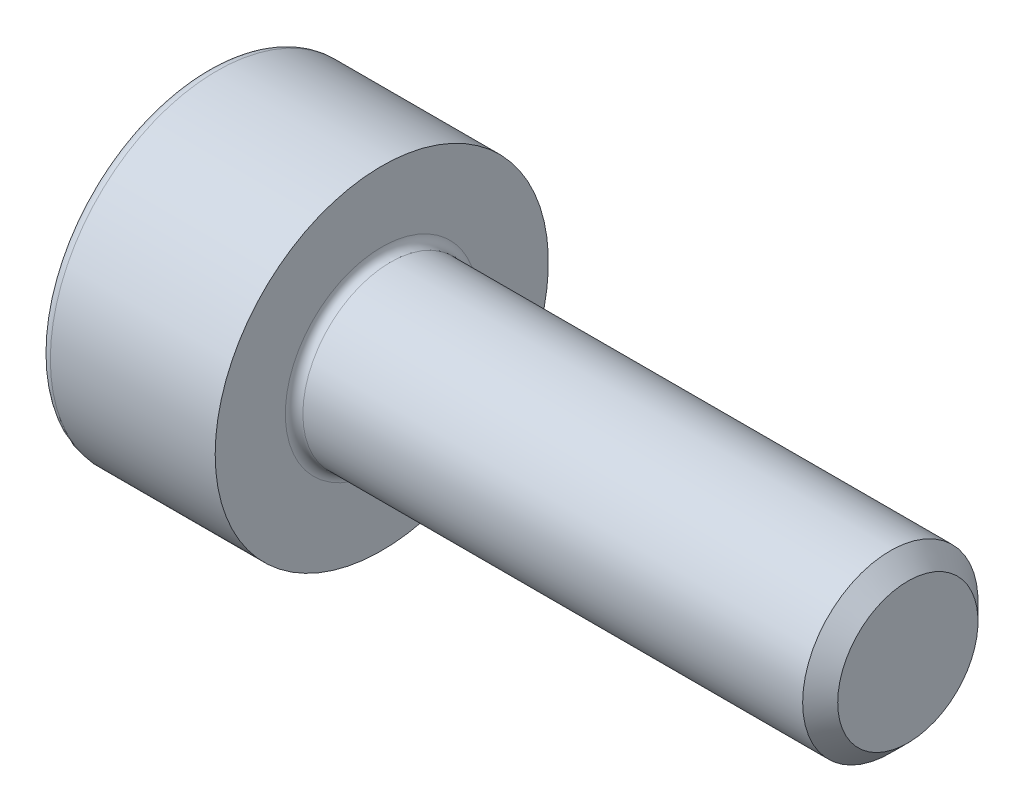
ISO-10303-21;
HEADER;
FILE_DESCRIPTION(('STEP AP214'),'2;1');
FILE_NAME('part.step','',(''),(''),'','','');
FILE_SCHEMA(('AUTOMOTIVE_DESIGN { 1 0 10303 214 1 1 1 1 }'));
ENDSEC;
DATA;
#1=APPLICATION_CONTEXT('core data for automotive mechanical design processes');
#2=APPLICATION_PROTOCOL_DEFINITION('international standard','automotive_design',2000,#1);
#3=PRODUCT_CONTEXT('',#1,'mechanical');
#4=PRODUCT('Part','Part','',(#3));
#5=PRODUCT_RELATED_PRODUCT_CATEGORY('part','',(#4));
#6=PRODUCT_DEFINITION_FORMATION('','',#4);
#7=PRODUCT_DEFINITION_CONTEXT('part definition',#1,'design');
#8=PRODUCT_DEFINITION('design','',#6,#7);
#9=PRODUCT_DEFINITION_SHAPE('','',#8);
#10=(LENGTH_UNIT() NAMED_UNIT(*) SI_UNIT(.MILLI.,.METRE.));
#11=(NAMED_UNIT(*) PLANE_ANGLE_UNIT() SI_UNIT($,.RADIAN.));
#12=(NAMED_UNIT(*) SI_UNIT($,.STERADIAN.) SOLID_ANGLE_UNIT());
#13=UNCERTAINTY_MEASURE_WITH_UNIT(LENGTH_MEASURE(1.E-05),#10,'distance_accuracy_value','');
#14=(GEOMETRIC_REPRESENTATION_CONTEXT(3) GLOBAL_UNCERTAINTY_ASSIGNED_CONTEXT((#13)) GLOBAL_UNIT_ASSIGNED_CONTEXT((#10,
#11,#12)) REPRESENTATION_CONTEXT('',''));
#15=CARTESIAN_POINT('',(0.,0.,0.));
#16=DIRECTION('',(0.,0.,1.));
#17=DIRECTION('',(1.,0.,0.));
#18=AXIS2_PLACEMENT_3D('',#15,#16,#17);
#19=CARTESIAN_POINT('',(8.,0.,0.));
#20=DIRECTION('',(-1.,0.,0.));
#21=DIRECTION('',(0.,0.,1.));
#22=AXIS2_PLACEMENT_3D('',#19,#20,#21);
#23=PLANE('',#22);
#24=CARTESIAN_POINT('',(8.,0.,0.));
#25=DIRECTION('',(-1.,0.,0.));
#26=DIRECTION('',(0.,0.,1.));
#27=AXIS2_PLACEMENT_3D('',#24,#25,#26);
#28=CIRCLE('',#27,0.800000000000001);
#29=CARTESIAN_POINT('',(8.,0.,0.8));
#30=VERTEX_POINT('',#29);
#31=EDGE_CURVE('E11',#30,#30,#28,.F.);
#32=ORIENTED_EDGE('',*,*,#31,.T.);
#33=EDGE_LOOP('',(#32));
#34=FACE_BOUND('',#33,.T.);
#35=ADVANCED_FACE('F35',(#34),#23,.F.);
#36=CARTESIAN_POINT('',(0.,0.,0.));
#37=DIRECTION('',(-1.,0.,0.));
#38=DIRECTION('',(0.,0.,1.));
#39=AXIS2_PLACEMENT_3D('',#36,#37,#38);
#40=CYLINDRICAL_SURFACE('',#39,1.);
#41=CARTESIAN_POINT('',(7.8,0.,0.));
#42=DIRECTION('',(-1.,0.,0.));
#43=DIRECTION('',(0.,0.,1.));
#44=AXIS2_PLACEMENT_3D('',#41,#42,#43);
#45=CIRCLE('',#44,1.);
#46=CARTESIAN_POINT('',(7.8,0.,0.999999999999999));
#47=VERTEX_POINT('',#46);
#48=EDGE_CURVE('E43',#47,#47,#45,.T.);
#49=ORIENTED_EDGE('',*,*,#48,.T.);
#50=EDGE_LOOP('',(#49));
#51=FACE_BOUND('',#50,.T.);
#52=CARTESIAN_POINT('',(2.1,0.,0.));
#53=DIRECTION('',(1.,0.,0.));
#54=DIRECTION('',(0.,0.,-1.));
#55=AXIS2_PLACEMENT_3D('',#52,#53,#54);
#56=CIRCLE('',#55,1.);
#57=CARTESIAN_POINT('',(2.1,0.,-1.));
#58=VERTEX_POINT('',#57);
#59=EDGE_CURVE('E148',#58,#58,#56,.T.);
#60=ORIENTED_EDGE('',*,*,#59,.T.);
#61=EDGE_LOOP('',(#60));
#62=FACE_BOUND('',#61,.T.);
#63=ADVANCED_FACE('F159',(#51,#62),#40,.T.);
#64=CARTESIAN_POINT('',(2.,0.,0.));
#65=DIRECTION('',(1.,0.,0.));
#66=DIRECTION('',(0.,0.,-1.));
#67=AXIS2_PLACEMENT_3D('',#64,#65,#66);
#68=PLANE('',#67);
#69=CARTESIAN_POINT('',(2.,0.,0.));
#70=DIRECTION('',(1.,0.,0.));
#71=DIRECTION('',(0.,0.,-1.));
#72=AXIS2_PLACEMENT_3D('',#69,#70,#71);
#73=CIRCLE('',#72,1.1);
#74=CARTESIAN_POINT('',(2.,0.,-1.1));
#75=VERTEX_POINT('',#74);
#76=EDGE_CURVE('E145',#75,#75,#73,.F.);
#77=ORIENTED_EDGE('',*,*,#76,.T.);
#78=EDGE_LOOP('',(#77));
#79=FACE_BOUND('',#78,.T.);
#80=CARTESIAN_POINT('',(2.,0.,0.));
#81=DIRECTION('',(-1.,0.,0.));
#82=DIRECTION('',(0.,0.,1.));
#83=AXIS2_PLACEMENT_3D('',#80,#81,#82);
#84=CIRCLE('',#83,1.9);
#85=CARTESIAN_POINT('',(2.,0.,1.9));
#86=VERTEX_POINT('',#85);
#87=EDGE_CURVE('E137',#86,#86,#84,.T.);
#88=ORIENTED_EDGE('',*,*,#87,.F.);
#89=EDGE_LOOP('',(#88));
#90=FACE_BOUND('',#89,.T.);
#91=ADVANCED_FACE('F181',(#79,#90),#68,.T.);
#92=CARTESIAN_POINT('',(0.,0.,0.));
#93=DIRECTION('',(-1.,0.,0.));
#94=DIRECTION('',(0.,0.,1.));
#95=AXIS2_PLACEMENT_3D('',#92,#93,#94);
#96=CYLINDRICAL_SURFACE('',#95,1.9);
#97=CARTESIAN_POINT('',(0.12,0.,0.));
#98=DIRECTION('',(-1.,0.,0.));
#99=DIRECTION('',(0.,0.,1.));
#100=AXIS2_PLACEMENT_3D('',#97,#98,#99);
#101=CIRCLE('',#100,1.9);
#102=CARTESIAN_POINT('',(0.12,0.,1.9));
#103=VERTEX_POINT('',#102);
#104=EDGE_CURVE('E154',#103,#103,#101,.F.);
#105=ORIENTED_EDGE('',*,*,#104,.T.);
#106=EDGE_LOOP('',(#105));
#107=FACE_BOUND('',#106,.T.);
#108=ORIENTED_EDGE('',*,*,#87,.T.);
#109=EDGE_LOOP('',(#108));
#110=FACE_BOUND('',#109,.T.);
#111=ADVANCED_FACE('F191',(#107,#110),#96,.T.);
#112=CARTESIAN_POINT('',(0.,0.,0.));
#113=DIRECTION('',(-1.,0.,0.));
#114=DIRECTION('',(0.,0.,1.));
#115=AXIS2_PLACEMENT_3D('',#112,#113,#114);
#116=PLANE('',#115);
#117=DIRECTION('',(0.,0.5,-0.866025403784439));
#118=VECTOR('',#117,1.);
#119=CARTESIAN_POINT('',(0.,0.43301270189222,0.749999999999999));
#120=LINE('',#119,#118);
#121=CARTESIAN_POINT('',(0.,0.43301270189222,0.749999999999999));
#122=VERTEX_POINT('',#121);
#123=CARTESIAN_POINT('',(0.,0.866025403784439,0.));
#124=VERTEX_POINT('',#123);
#125=EDGE_CURVE('E50',#122,#124,#120,.T.);
#126=ORIENTED_EDGE('',*,*,#125,.F.);
#127=DIRECTION('',(0.,1.,0.));
#128=VECTOR('',#127,1.);
#129=CARTESIAN_POINT('',(0.,-0.433012701892219,0.75));
#130=LINE('',#129,#128);
#131=CARTESIAN_POINT('',(0.,-0.433012701892219,0.75));
#132=VERTEX_POINT('',#131);
#133=EDGE_CURVE('E133',#132,#122,#130,.T.);
#134=ORIENTED_EDGE('',*,*,#133,.F.);
#135=DIRECTION('',(0.,0.5,0.866025403784439));
#136=VECTOR('',#135,1.);
#137=CARTESIAN_POINT('',(0.,-0.866025403784438,0.));
#138=LINE('',#137,#136);
#139=CARTESIAN_POINT('',(0.,-0.866025403784438,0.));
#140=VERTEX_POINT('',#139);
#141=EDGE_CURVE('E131',#140,#132,#138,.T.);
#142=ORIENTED_EDGE('',*,*,#141,.F.);
#143=DIRECTION('',(0.,-0.5,0.866025403784439));
#144=VECTOR('',#143,1.);
#145=CARTESIAN_POINT('',(0.,-0.433012701892219,-0.75));
#146=LINE('',#145,#144);
#147=CARTESIAN_POINT('',(0.,-0.433012701892219,-0.75));
#148=VERTEX_POINT('',#147);
#149=EDGE_CURVE('E98',#148,#140,#146,.T.);
#150=ORIENTED_EDGE('',*,*,#149,.F.);
#151=DIRECTION('',(0.,-1.,0.));
#152=VECTOR('',#151,1.);
#153=CARTESIAN_POINT('',(0.,0.433012701892219,-0.75));
#154=LINE('',#153,#152);
#155=CARTESIAN_POINT('',(0.,0.433012701892219,-0.75));
#156=VERTEX_POINT('',#155);
#157=EDGE_CURVE('E127',#156,#148,#154,.T.);
#158=ORIENTED_EDGE('',*,*,#157,.F.);
#159=DIRECTION('',(0.,-0.5,-0.866025403784439));
#160=VECTOR('',#159,1.);
#161=CARTESIAN_POINT('',(0.,0.866025403784439,0.));
#162=LINE('',#161,#160);
#163=EDGE_CURVE('E124',#124,#156,#162,.T.);
#164=ORIENTED_EDGE('',*,*,#163,.F.);
#165=EDGE_LOOP('',(#126,#134,#142,#150,#158,#164));
#166=FACE_BOUND('',#165,.T.);
#167=CARTESIAN_POINT('',(0.,0.,0.));
#168=DIRECTION('',(-1.,0.,0.));
#169=DIRECTION('',(0.,0.,1.));
#170=AXIS2_PLACEMENT_3D('',#167,#168,#169);
#171=CIRCLE('',#170,1.78);
#172=CARTESIAN_POINT('',(0.,0.,1.78));
#173=VERTEX_POINT('',#172);
#174=EDGE_CURVE('E151',#173,#173,#171,.T.);
#175=ORIENTED_EDGE('',*,*,#174,.T.);
#176=EDGE_LOOP('',(#175));
#177=FACE_BOUND('',#176,.T.);
#178=ADVANCED_FACE('F186',(#166,#177),#116,.T.);
#179=CARTESIAN_POINT('',(2.1,0.,0.));
#180=DIRECTION('',(1.,0.,0.));
#181=DIRECTION('',(0.,0.,-1.));
#182=AXIS2_PLACEMENT_3D('',#179,#180,#181);
#183=TOROIDAL_SURFACE('',#182,1.1,0.1);
#184=ORIENTED_EDGE('',*,*,#59,.F.);
#185=EDGE_LOOP('',(#184));
#186=FACE_BOUND('',#185,.T.);
#187=ORIENTED_EDGE('',*,*,#76,.F.);
#188=EDGE_LOOP('',(#187));
#189=FACE_BOUND('',#188,.T.);
#190=ADVANCED_FACE('F172',(#186,#189),#183,.F.);
#191=CARTESIAN_POINT('',(0.12,0.,0.));
#192=DIRECTION('',(-1.,0.,0.));
#193=DIRECTION('',(0.,0.,1.));
#194=AXIS2_PLACEMENT_3D('',#191,#192,#193);
#195=TOROIDAL_SURFACE('',#194,1.78,0.12);
#196=ORIENTED_EDGE('',*,*,#104,.F.);
#197=EDGE_LOOP('',(#196));
#198=FACE_BOUND('',#197,.T.);
#199=ORIENTED_EDGE('',*,*,#174,.F.);
#200=EDGE_LOOP('',(#199));
#201=FACE_BOUND('',#200,.T.);
#202=ADVANCED_FACE('F164',(#198,#201),#195,.T.);
#203=CARTESIAN_POINT('',(7.8,0.,0.));
#204=DIRECTION('',(-1.,0.,0.));
#205=DIRECTION('',(0.,0.,1.));
#206=AXIS2_PLACEMENT_3D('',#203,#204,#205);
#207=CONICAL_SURFACE('',#206,1.,0.785398163397446);
#208=CARTESIAN_POINT('',(8.,0.,0.8));
#209=CARTESIAN_POINT('',(7.99791666666667,0.,0.802083333333333));
#210=CARTESIAN_POINT('',(7.99583333333333,0.,0.804166666666667));
#211=CARTESIAN_POINT('',(7.99166666666667,0.,0.808333333333334));
#212=CARTESIAN_POINT('',(7.98958333333333,0.,0.810416666666667));
#213=CARTESIAN_POINT('',(7.98541666666667,0.,0.814583333333334));
#214=CARTESIAN_POINT('',(7.98333333333333,0.,0.816666666666667));
#215=CARTESIAN_POINT('',(7.97916666666667,0.,0.820833333333333));
#216=CARTESIAN_POINT('',(7.97708333333333,0.,0.822916666666667));
#217=CARTESIAN_POINT('',(7.97291666666667,0.,0.827083333333334));
#218=CARTESIAN_POINT('',(7.97083333333333,0.,0.829166666666667));
#219=CARTESIAN_POINT('',(7.96666666666667,0.,0.833333333333334));
#220=CARTESIAN_POINT('',(7.96458333333333,0.,0.835416666666667));
#221=CARTESIAN_POINT('',(7.96041666666667,0.,0.839583333333333));
#222=CARTESIAN_POINT('',(7.95833333333333,0.,0.841666666666667));
#223=CARTESIAN_POINT('',(7.95416666666667,0.,0.845833333333334));
#224=CARTESIAN_POINT('',(7.95208333333333,0.,0.847916666666667));
#225=CARTESIAN_POINT('',(7.94791666666667,0.,0.852083333333333));
#226=CARTESIAN_POINT('',(7.94583333333333,0.,0.854166666666667));
#227=CARTESIAN_POINT('',(7.94166666666667,0.,0.858333333333334));
#228=CARTESIAN_POINT('',(7.93958333333333,0.,0.860416666666667));
#229=CARTESIAN_POINT('',(7.93541666666667,0.,0.864583333333333));
#230=CARTESIAN_POINT('',(7.93333333333333,0.,0.866666666666666));
#231=CARTESIAN_POINT('',(7.92916666666667,0.,0.870833333333333));
#232=CARTESIAN_POINT('',(7.92708333333333,0.,0.872916666666667));
#233=CARTESIAN_POINT('',(7.92291666666667,0.,0.877083333333333));
#234=CARTESIAN_POINT('',(7.92083333333333,0.,0.879166666666667));
#235=CARTESIAN_POINT('',(7.91666666666667,0.,0.883333333333333));
#236=CARTESIAN_POINT('',(7.91458333333333,0.,0.885416666666667));
#237=CARTESIAN_POINT('',(7.91041666666667,0.,0.889583333333333));
#238=CARTESIAN_POINT('',(7.90833333333333,0.,0.891666666666667));
#239=CARTESIAN_POINT('',(7.90416666666667,0.,0.895833333333333));
#240=CARTESIAN_POINT('',(7.90208333333333,0.,0.897916666666666));
#241=CARTESIAN_POINT('',(7.89791666666667,0.,0.902083333333333));
#242=CARTESIAN_POINT('',(7.89583333333333,0.,0.904166666666667));
#243=CARTESIAN_POINT('',(7.89166666666667,0.,0.908333333333333));
#244=CARTESIAN_POINT('',(7.88958333333333,0.,0.910416666666666));
#245=CARTESIAN_POINT('',(7.88541666666667,0.,0.914583333333333));
#246=CARTESIAN_POINT('',(7.88333333333333,0.,0.916666666666666));
#247=CARTESIAN_POINT('',(7.87916666666667,0.,0.920833333333333));
#248=CARTESIAN_POINT('',(7.87708333333333,0.,0.922916666666667));
#249=CARTESIAN_POINT('',(7.87291666666667,0.,0.927083333333333));
#250=CARTESIAN_POINT('',(7.87083333333333,0.,0.929166666666666));
#251=CARTESIAN_POINT('',(7.86666666666667,0.,0.933333333333333));
#252=CARTESIAN_POINT('',(7.86458333333333,0.,0.935416666666666));
#253=CARTESIAN_POINT('',(7.86041666666667,0.,0.939583333333333));
#254=CARTESIAN_POINT('',(7.85833333333333,0.,0.941666666666666));
#255=CARTESIAN_POINT('',(7.85416666666667,0.,0.945833333333333));
#256=CARTESIAN_POINT('',(7.85208333333333,0.,0.947916666666666));
#257=CARTESIAN_POINT('',(7.84791666666667,0.,0.952083333333333));
#258=CARTESIAN_POINT('',(7.84583333333333,0.,0.954166666666666));
#259=CARTESIAN_POINT('',(7.84166666666667,0.,0.958333333333333));
#260=CARTESIAN_POINT('',(7.83958333333333,0.,0.960416666666666));
#261=CARTESIAN_POINT('',(7.83541666666667,0.,0.964583333333333));
#262=CARTESIAN_POINT('',(7.83333333333333,0.,0.966666666666666));
#263=CARTESIAN_POINT('',(7.82916666666667,0.,0.970833333333333));
#264=CARTESIAN_POINT('',(7.82708333333333,0.,0.972916666666666));
#265=CARTESIAN_POINT('',(7.82291666666667,0.,0.977083333333333));
#266=CARTESIAN_POINT('',(7.82083333333333,0.,0.979166666666666));
#267=CARTESIAN_POINT('',(7.81666666666667,0.,0.983333333333333));
#268=CARTESIAN_POINT('',(7.81458333333333,0.,0.985416666666666));
#269=CARTESIAN_POINT('',(7.81041666666667,0.,0.989583333333333));
#270=CARTESIAN_POINT('',(7.80833333333333,0.,0.991666666666666));
#271=CARTESIAN_POINT('',(7.80416666666667,0.,0.995833333333332));
#272=CARTESIAN_POINT('',(7.80208333333333,0.,0.997916666666666));
#273=CARTESIAN_POINT('',(7.8,0.,0.999999999999999));
#274=B_SPLINE_CURVE_WITH_KNOTS('',3,(#208,#209,#210,#211,#212,#213,#214,#215,#216,#217,#218,
#219,#220,#221,#222,#223,#224,#225,#226,#227,#228,#229,#230,#231,#232,#233,#234,#235,#236,#237,
#238,#239,#240,#241,#242,#243,#244,#245,#246,#247,#248,#249,#250,#251,#252,#253,#254,#255,#256,
#257,#258,#259,#260,#261,#262,#263,#264,#265,#266,#267,#268,#269,#270,#271,#272,#273),
.UNSPECIFIED.,.F.,.F.,(4,2,2,2,2,2,2,2,2,2,2,2,2,2,2,2,2,2,2,2,2,2,2,2,2,2,2,2,2,2,2,2,4),(0.,
0.00883883476483256,0.0176776695296639,0.0265165042944964,0.0353553390593278,0.0441941738241591,
0.0530330085889917,0.061871843353823,0.0707106781186556,0.0795495128834869,0.0883883476483182,
0.0972271824131508,0.106066017177982,0.114904851942815,0.123743686707646,0.132582521472477,
0.14142135623731,0.150260191002141,0.159099025766974,0.167937860531805,0.176776695296637,
0.185615530061469,0.1944543648263,0.203293199591133,0.212132034355964,0.220970869120796,
0.229809703885628,0.23864853865046,0.247487373415292,0.256326208180124,0.265165042944955,
0.274003877709787,0.282842712474619),.UNSPECIFIED.);
#275=EDGE_CURVE('BSEAM37',#30,#47,#274,.T.);
#276=ORIENTED_EDGE('',*,*,#31,.F.);
#277=ORIENTED_EDGE('',*,*,#48,.F.);
#278=ORIENTED_EDGE('',*,*,#275,.T.);
#279=ORIENTED_EDGE('',*,*,#275,.F.);
#280=EDGE_LOOP('',(#276,#278,#277,#279));
#281=FACE_BOUND('',#280,.T.);
#282=ADVANCED_FACE('F37',(#281),#207,.T.);
#283=CARTESIAN_POINT('',(1.,0.43301270189222,0.749999999999999));
#284=DIRECTION('',(0.,0.866025403784439,0.5));
#285=DIRECTION('',(0.,-0.5,0.866025403784439));
#286=AXIS2_PLACEMENT_3D('',#283,#284,#285);
#287=PLANE('',#286);
#288=ORIENTED_EDGE('',*,*,#125,.T.);
#289=DIRECTION('',(-1.,0.,0.));
#290=VECTOR('',#289,1.);
#291=CARTESIAN_POINT('',(1.,0.866025403784439,0.));
#292=LINE('',#291,#290);
#293=CARTESIAN_POINT('',(1.,0.866025403784439,0.));
#294=VERTEX_POINT('',#293);
#295=EDGE_CURVE('E80',#294,#124,#292,.T.);
#296=ORIENTED_EDGE('',*,*,#295,.F.);
#297=DIRECTION('',(0.,0.5,-0.866025403784439));
#298=VECTOR('',#297,1.);
#299=CARTESIAN_POINT('',(1.,0.43301270189222,0.749999999999999));
#300=LINE('',#299,#298);
#301=CARTESIAN_POINT('',(1.,0.43301270189222,0.749999999999999));
#302=VERTEX_POINT('',#301);
#303=EDGE_CURVE('E135',#302,#294,#300,.T.);
#304=ORIENTED_EDGE('',*,*,#303,.F.);
#305=DIRECTION('',(-1.,0.,0.));
#306=VECTOR('',#305,1.);
#307=CARTESIAN_POINT('',(1.,0.43301270189222,0.749999999999999));
#308=LINE('',#307,#306);
#309=EDGE_CURVE('E58',#302,#122,#308,.T.);
#310=ORIENTED_EDGE('',*,*,#309,.T.);
#311=EDGE_LOOP('',(#288,#296,#304,#310));
#312=FACE_BOUND('',#311,.T.);
#313=ADVANCED_FACE('F163',(#312),#287,.F.);
#314=CARTESIAN_POINT('',(1.,-0.433012701892219,0.75));
#315=DIRECTION('',(0.,0.,1.));
#316=DIRECTION('',(0.,-1.,0.));
#317=AXIS2_PLACEMENT_3D('',#314,#315,#316);
#318=PLANE('',#317);
#319=ORIENTED_EDGE('',*,*,#133,.T.);
#320=ORIENTED_EDGE('',*,*,#309,.F.);
#321=DIRECTION('',(0.,1.,0.));
#322=VECTOR('',#321,1.);
#323=CARTESIAN_POINT('',(1.,-0.433012701892219,0.75));
#324=LINE('',#323,#322);
#325=CARTESIAN_POINT('',(1.,-0.433012701892219,0.75));
#326=VERTEX_POINT('',#325);
#327=EDGE_CURVE('E110',#326,#302,#324,.T.);
#328=ORIENTED_EDGE('',*,*,#327,.F.);
#329=DIRECTION('',(-1.,0.,0.));
#330=VECTOR('',#329,1.);
#331=CARTESIAN_POINT('',(1.,-0.433012701892219,0.75));
#332=LINE('',#331,#330);
#333=EDGE_CURVE('E102',#326,#132,#332,.T.);
#334=ORIENTED_EDGE('',*,*,#333,.T.);
#335=EDGE_LOOP('',(#319,#320,#328,#334));
#336=FACE_BOUND('',#335,.T.);
#337=ADVANCED_FACE('F170',(#336),#318,.F.);
#338=CARTESIAN_POINT('',(1.,-0.866025403784438,0.));
#339=DIRECTION('',(0.,-0.866025403784439,0.5));
#340=DIRECTION('',(0.,-0.5,-0.866025403784439));
#341=AXIS2_PLACEMENT_3D('',#338,#339,#340);
#342=PLANE('',#341);
#343=ORIENTED_EDGE('',*,*,#141,.T.);
#344=ORIENTED_EDGE('',*,*,#333,.F.);
#345=DIRECTION('',(0.,0.5,0.866025403784439));
#346=VECTOR('',#345,1.);
#347=CARTESIAN_POINT('',(1.,-0.866025403784438,0.));
#348=LINE('',#347,#346);
#349=CARTESIAN_POINT('',(1.,-0.866025403784438,0.));
#350=VERTEX_POINT('',#349);
#351=EDGE_CURVE('E106',#350,#326,#348,.T.);
#352=ORIENTED_EDGE('',*,*,#351,.F.);
#353=DIRECTION('',(-1.,0.,0.));
#354=VECTOR('',#353,1.);
#355=CARTESIAN_POINT('',(1.,-0.866025403784438,0.));
#356=LINE('',#355,#354);
#357=EDGE_CURVE('E91',#350,#140,#356,.T.);
#358=ORIENTED_EDGE('',*,*,#357,.T.);
#359=EDGE_LOOP('',(#343,#344,#352,#358));
#360=FACE_BOUND('',#359,.T.);
#361=ADVANCED_FACE('F107',(#360),#342,.F.);
#362=CARTESIAN_POINT('',(1.,-0.433012701892219,-0.75));
#363=DIRECTION('',(0.,-0.866025403784439,-0.5));
#364=DIRECTION('',(0.,0.5,-0.866025403784439));
#365=AXIS2_PLACEMENT_3D('',#362,#363,#364);
#366=PLANE('',#365);
#367=ORIENTED_EDGE('',*,*,#149,.T.);
#368=ORIENTED_EDGE('',*,*,#357,.F.);
#369=DIRECTION('',(0.,-0.5,0.866025403784439));
#370=VECTOR('',#369,1.);
#371=CARTESIAN_POINT('',(1.,-0.433012701892219,-0.75));
#372=LINE('',#371,#370);
#373=CARTESIAN_POINT('',(1.,-0.433012701892219,-0.75));
#374=VERTEX_POINT('',#373);
#375=EDGE_CURVE('E95',#374,#350,#372,.T.);
#376=ORIENTED_EDGE('',*,*,#375,.F.);
#377=DIRECTION('',(-1.,0.,0.));
#378=VECTOR('',#377,1.);
#379=CARTESIAN_POINT('',(1.,-0.433012701892219,-0.75));
#380=LINE('',#379,#378);
#381=EDGE_CURVE('E103',#374,#148,#380,.T.);
#382=ORIENTED_EDGE('',*,*,#381,.T.);
#383=EDGE_LOOP('',(#367,#368,#376,#382));
#384=FACE_BOUND('',#383,.T.);
#385=ADVANCED_FACE('F93',(#384),#366,.F.);
#386=CARTESIAN_POINT('',(1.,0.433012701892219,-0.75));
#387=DIRECTION('',(0.,0.,-1.));
#388=DIRECTION('',(0.,1.,0.));
#389=AXIS2_PLACEMENT_3D('',#386,#387,#388);
#390=PLANE('',#389);
#391=ORIENTED_EDGE('',*,*,#157,.T.);
#392=ORIENTED_EDGE('',*,*,#381,.F.);
#393=DIRECTION('',(0.,-1.,0.));
#394=VECTOR('',#393,1.);
#395=CARTESIAN_POINT('',(1.,0.433012701892219,-0.75));
#396=LINE('',#395,#394);
#397=CARTESIAN_POINT('',(1.,0.433012701892219,-0.75));
#398=VERTEX_POINT('',#397);
#399=EDGE_CURVE('E116',#398,#374,#396,.T.);
#400=ORIENTED_EDGE('',*,*,#399,.F.);
#401=DIRECTION('',(-1.,0.,0.));
#402=VECTOR('',#401,1.);
#403=CARTESIAN_POINT('',(1.,0.433012701892219,-0.75));
#404=LINE('',#403,#402);
#405=EDGE_CURVE('E140',#398,#156,#404,.T.);
#406=ORIENTED_EDGE('',*,*,#405,.T.);
#407=EDGE_LOOP('',(#391,#392,#400,#406));
#408=FACE_BOUND('',#407,.T.);
#409=ADVANCED_FACE('F211',(#408),#390,.F.);
#410=CARTESIAN_POINT('',(1.,0.866025403784439,0.));
#411=DIRECTION('',(0.,0.866025403784439,-0.5));
#412=DIRECTION('',(0.,0.5,0.866025403784439));
#413=AXIS2_PLACEMENT_3D('',#410,#411,#412);
#414=PLANE('',#413);
#415=ORIENTED_EDGE('',*,*,#163,.T.);
#416=ORIENTED_EDGE('',*,*,#405,.F.);
#417=DIRECTION('',(0.,-0.5,-0.866025403784439));
#418=VECTOR('',#417,1.);
#419=CARTESIAN_POINT('',(1.,0.866025403784439,0.));
#420=LINE('',#419,#418);
#421=EDGE_CURVE('E118',#294,#398,#420,.T.);
#422=ORIENTED_EDGE('',*,*,#421,.F.);
#423=ORIENTED_EDGE('',*,*,#295,.T.);
#424=EDGE_LOOP('',(#415,#416,#422,#423));
#425=FACE_BOUND('',#424,.T.);
#426=ADVANCED_FACE('F208',(#425),#414,.F.);
#427=CARTESIAN_POINT('',(1.,0.,0.));
#428=DIRECTION('',(-1.,0.,0.));
#429=DIRECTION('',(0.,0.,1.));
#430=AXIS2_PLACEMENT_3D('',#427,#428,#429);
#431=PLANE('',#430);
#432=ORIENTED_EDGE('',*,*,#303,.T.);
#433=ORIENTED_EDGE('',*,*,#421,.T.);
#434=ORIENTED_EDGE('',*,*,#399,.T.);
#435=ORIENTED_EDGE('',*,*,#375,.T.);
#436=ORIENTED_EDGE('',*,*,#351,.T.);
#437=ORIENTED_EDGE('',*,*,#327,.T.);
#438=EDGE_LOOP('',(#432,#433,#434,#435,#436,#437));
#439=FACE_BOUND('',#438,.T.);
#440=ADVANCED_FACE('F113',(#439),#431,.T.);
#441=CLOSED_SHELL('',(#35,#63,#91,#111,#178,#190,#202,#282,#313,#337,#361,#385,#409,#426,#440));
#442=MANIFOLD_SOLID_BREP('B2',#441);
#443=ADVANCED_BREP_SHAPE_REPRESENTATION('',(#18,#442),#14);
#444=SHAPE_DEFINITION_REPRESENTATION(#9,#443);
ENDSEC;
END-ISO-10303-21;
